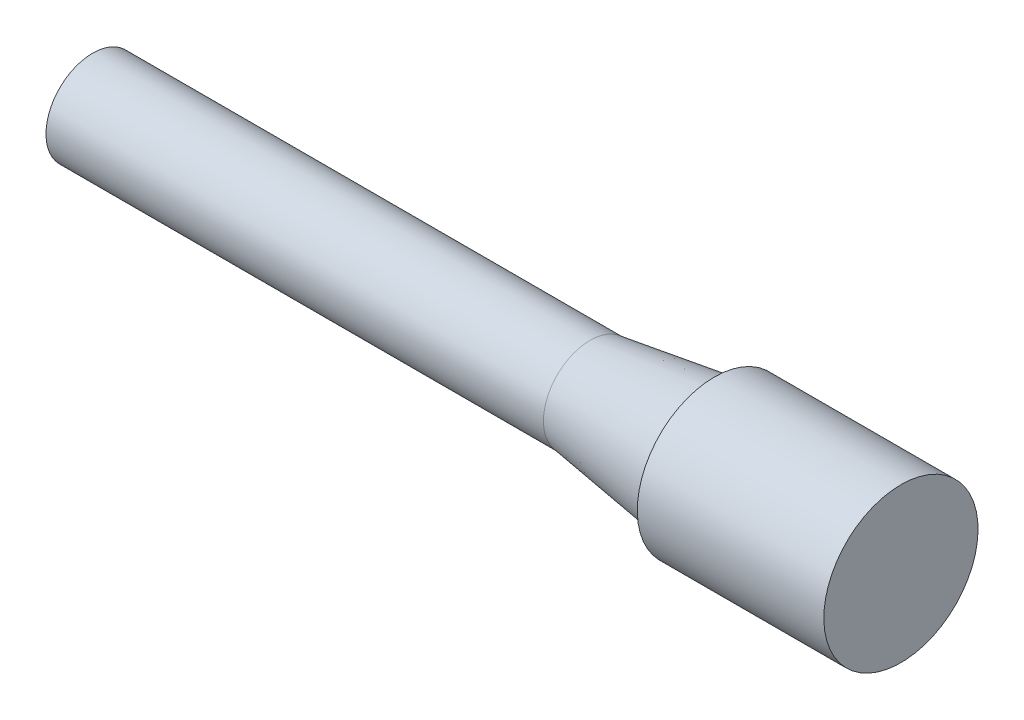
ISO-10303-21;
HEADER;
FILE_DESCRIPTION(('STEP AP214'),'2;1');
FILE_NAME('part.step','',(''),(''),'','','');
FILE_SCHEMA(('AUTOMOTIVE_DESIGN { 1 0 10303 214 1 1 1 1 }'));
ENDSEC;
DATA;
#1=APPLICATION_CONTEXT('core data for automotive mechanical design processes');
#2=APPLICATION_PROTOCOL_DEFINITION('international standard','automotive_design',2000,#1);
#3=PRODUCT_CONTEXT('',#1,'mechanical');
#4=PRODUCT('Part','Part','',(#3));
#5=PRODUCT_RELATED_PRODUCT_CATEGORY('part','',(#4));
#6=PRODUCT_DEFINITION_FORMATION('','',#4);
#7=PRODUCT_DEFINITION_CONTEXT('part definition',#1,'design');
#8=PRODUCT_DEFINITION('design','',#6,#7);
#9=PRODUCT_DEFINITION_SHAPE('','',#8);
#10=(LENGTH_UNIT() NAMED_UNIT(*) SI_UNIT(.MILLI.,.METRE.));
#11=(NAMED_UNIT(*) PLANE_ANGLE_UNIT() SI_UNIT($,.RADIAN.));
#12=(NAMED_UNIT(*) SI_UNIT($,.STERADIAN.) SOLID_ANGLE_UNIT());
#13=UNCERTAINTY_MEASURE_WITH_UNIT(LENGTH_MEASURE(1.E-05),#10,'distance_accuracy_value','');
#14=(GEOMETRIC_REPRESENTATION_CONTEXT(3) GLOBAL_UNCERTAINTY_ASSIGNED_CONTEXT((#13)) GLOBAL_UNIT_ASSIGNED_CONTEXT((#10,
#11,#12)) REPRESENTATION_CONTEXT('',''));
#15=CARTESIAN_POINT('',(0.,0.,0.));
#16=DIRECTION('',(0.,0.,1.));
#17=DIRECTION('',(1.,0.,0.));
#18=AXIS2_PLACEMENT_3D('',#15,#16,#17);
#19=CARTESIAN_POINT('',(0.,7.874,0.));
#20=DIRECTION('',(1.,0.,0.));
#21=DIRECTION('',(0.,1.,0.));
#22=AXIS2_PLACEMENT_3D('',#19,#20,#21);
#23=PLANE('',#22);
#24=CARTESIAN_POINT('',(0.,0.,0.));
#25=DIRECTION('',(1.,0.,0.));
#26=DIRECTION('',(0.,1.,0.));
#27=AXIS2_PLACEMENT_3D('',#24,#25,#26);
#28=CIRCLE('',#27,7.874);
#29=CARTESIAN_POINT('',(0.,7.874,0.));
#30=VERTEX_POINT('',#29);
#31=EDGE_CURVE('E55',#30,#30,#28,.T.);
#32=ORIENTED_EDGE('',*,*,#31,.T.);
#33=EDGE_LOOP('',(#32));
#34=FACE_BOUND('',#33,.T.);
#35=ADVANCED_FACE('F36',(#34),#23,.T.);
#36=CARTESIAN_POINT('',(-82.55,0.,0.));
#37=DIRECTION('',(-1.,0.,0.));
#38=DIRECTION('',(0.,-1.,0.));
#39=AXIS2_PLACEMENT_3D('',#36,#37,#38);
#40=PLANE('',#39);
#41=CARTESIAN_POINT('',(-82.55,0.,0.));
#42=DIRECTION('',(1.,0.,0.));
#43=DIRECTION('',(0.,1.,0.));
#44=AXIS2_PLACEMENT_3D('',#41,#42,#43);
#45=CIRCLE('',#44,4.76250000000001);
#46=CARTESIAN_POINT('',(-82.55,4.7625,0.));
#47=VERTEX_POINT('',#46);
#48=EDGE_CURVE('E10',#47,#47,#45,.T.);
#49=ORIENTED_EDGE('',*,*,#48,.F.);
#50=EDGE_LOOP('',(#49));
#51=FACE_BOUND('',#50,.T.);
#52=ADVANCED_FACE('F72',(#51),#40,.T.);
#53=CARTESIAN_POINT('',(0.,0.,0.));
#54=DIRECTION('',(1.,0.,0.));
#55=DIRECTION('',(0.,1.,0.));
#56=AXIS2_PLACEMENT_3D('',#53,#54,#55);
#57=CYLINDRICAL_SURFACE('',#56,4.7625);
#58=ORIENTED_EDGE('',*,*,#48,.T.);
#59=EDGE_LOOP('',(#58));
#60=FACE_BOUND('',#59,.T.);
#61=CARTESIAN_POINT('',(-31.75,0.,0.));
#62=DIRECTION('',(1.,0.,0.));
#63=DIRECTION('',(0.,1.,0.));
#64=AXIS2_PLACEMENT_3D('',#61,#62,#63);
#65=CIRCLE('',#64,4.7625);
#66=CARTESIAN_POINT('',(-31.75,4.7625,0.));
#67=VERTEX_POINT('',#66);
#68=EDGE_CURVE('E42',#67,#67,#65,.T.);
#69=ORIENTED_EDGE('',*,*,#68,.F.);
#70=EDGE_LOOP('',(#69));
#71=FACE_BOUND('',#70,.T.);
#72=ADVANCED_FACE('F76',(#60,#71),#57,.T.);
#73=CARTESIAN_POINT('',(-19.05,0.,0.));
#74=DIRECTION('',(1.,0.,0.));
#75=DIRECTION('',(0.,1.,0.));
#76=AXIS2_PLACEMENT_3D('',#73,#74,#75);
#77=CONICAL_SURFACE('',#76,6.604,0.143996421708892);
#78=ORIENTED_EDGE('',*,*,#68,.T.);
#79=EDGE_LOOP('',(#78));
#80=FACE_BOUND('',#79,.T.);
#81=CARTESIAN_POINT('',(-19.05,0.,0.));
#82=DIRECTION('',(1.,0.,0.));
#83=DIRECTION('',(0.,1.,0.));
#84=AXIS2_PLACEMENT_3D('',#81,#82,#83);
#85=CIRCLE('',#84,6.604);
#86=CARTESIAN_POINT('',(-19.05,6.604,0.));
#87=VERTEX_POINT('',#86);
#88=EDGE_CURVE('E46',#87,#87,#85,.T.);
#89=ORIENTED_EDGE('',*,*,#88,.F.);
#90=EDGE_LOOP('',(#89));
#91=FACE_BOUND('',#90,.T.);
#92=ADVANCED_FACE('F68',(#80,#91),#77,.T.);
#93=CARTESIAN_POINT('',(-19.05,6.604,0.));
#94=DIRECTION('',(-1.,0.,0.));
#95=DIRECTION('',(0.,-1.,0.));
#96=AXIS2_PLACEMENT_3D('',#93,#94,#95);
#97=PLANE('',#96);
#98=ORIENTED_EDGE('',*,*,#88,.T.);
#99=EDGE_LOOP('',(#98));
#100=FACE_BOUND('',#99,.T.);
#101=CARTESIAN_POINT('',(-19.05,0.,0.));
#102=DIRECTION('',(1.,0.,0.));
#103=DIRECTION('',(0.,1.,0.));
#104=AXIS2_PLACEMENT_3D('',#101,#102,#103);
#105=CIRCLE('',#104,7.874);
#106=CARTESIAN_POINT('',(-19.05,7.874,0.));
#107=VERTEX_POINT('',#106);
#108=EDGE_CURVE('E50',#107,#107,#105,.T.);
#109=ORIENTED_EDGE('',*,*,#108,.F.);
#110=EDGE_LOOP('',(#109));
#111=FACE_BOUND('',#110,.T.);
#112=ADVANCED_FACE('F62',(#100,#111),#97,.T.);
#113=CARTESIAN_POINT('',(0.,0.,0.));
#114=DIRECTION('',(1.,0.,0.));
#115=DIRECTION('',(0.,1.,0.));
#116=AXIS2_PLACEMENT_3D('',#113,#114,#115);
#117=CYLINDRICAL_SURFACE('',#116,7.874);
#118=ORIENTED_EDGE('',*,*,#108,.T.);
#119=EDGE_LOOP('',(#118));
#120=FACE_BOUND('',#119,.T.);
#121=ORIENTED_EDGE('',*,*,#31,.F.);
#122=EDGE_LOOP('',(#121));
#123=FACE_BOUND('',#122,.T.);
#124=ADVANCED_FACE('F60',(#120,#123),#117,.T.);
#125=CLOSED_SHELL('',(#35,#52,#72,#92,#112,#124));
#126=MANIFOLD_SOLID_BREP('B2',#125);
#127=ADVANCED_BREP_SHAPE_REPRESENTATION('',(#18,#126),#14);
#128=SHAPE_DEFINITION_REPRESENTATION(#9,#127);
ENDSEC;
END-ISO-10303-21;
